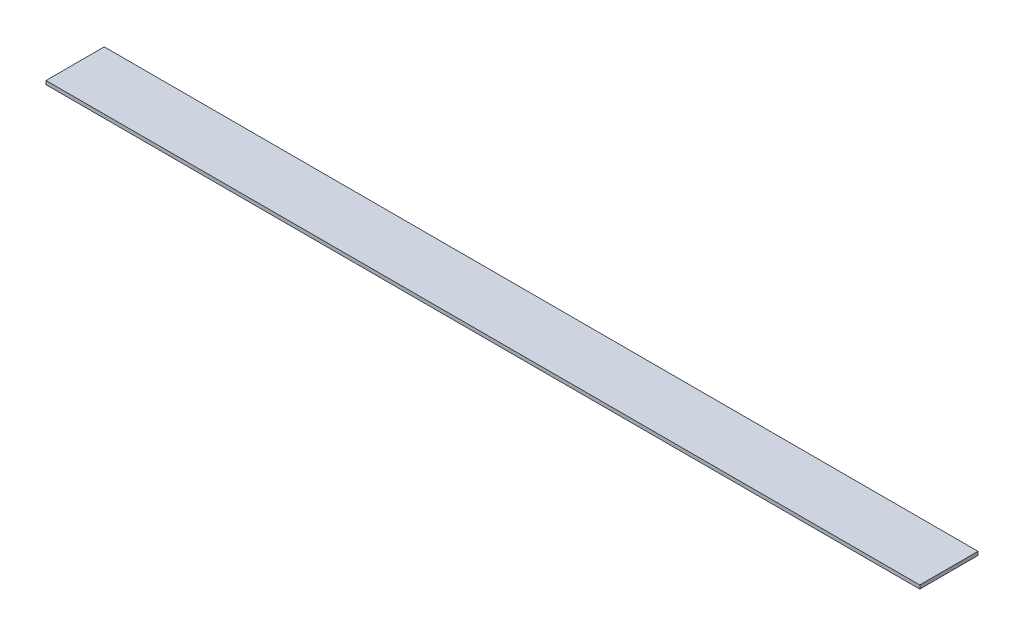
ISO-10303-21;
HEADER;
FILE_DESCRIPTION(('STEP AP214'),'2;1');
FILE_NAME('part.step','',(''),(''),'','','');
FILE_SCHEMA(('AUTOMOTIVE_DESIGN { 1 0 10303 214 1 1 1 1 }'));
ENDSEC;
DATA;
#1=APPLICATION_CONTEXT('core data for automotive mechanical design processes');
#2=APPLICATION_PROTOCOL_DEFINITION('international standard','automotive_design',2000,#1);
#3=PRODUCT_CONTEXT('',#1,'mechanical');
#4=PRODUCT('Part','Part','',(#3));
#5=PRODUCT_RELATED_PRODUCT_CATEGORY('part','',(#4));
#6=PRODUCT_DEFINITION_FORMATION('','',#4);
#7=PRODUCT_DEFINITION_CONTEXT('part definition',#1,'design');
#8=PRODUCT_DEFINITION('design','',#6,#7);
#9=PRODUCT_DEFINITION_SHAPE('','',#8);
#10=(LENGTH_UNIT() NAMED_UNIT(*) SI_UNIT(.MILLI.,.METRE.));
#11=(NAMED_UNIT(*) PLANE_ANGLE_UNIT() SI_UNIT($,.RADIAN.));
#12=(NAMED_UNIT(*) SI_UNIT($,.STERADIAN.) SOLID_ANGLE_UNIT());
#13=UNCERTAINTY_MEASURE_WITH_UNIT(LENGTH_MEASURE(1.E-05),#10,'distance_accuracy_value','');
#14=(GEOMETRIC_REPRESENTATION_CONTEXT(3) GLOBAL_UNCERTAINTY_ASSIGNED_CONTEXT((#13)) GLOBAL_UNIT_ASSIGNED_CONTEXT((#10,
#11,#12)) REPRESENTATION_CONTEXT('',''));
#15=CARTESIAN_POINT('',(0.,0.,0.));
#16=DIRECTION('',(0.,0.,1.));
#17=DIRECTION('',(1.,0.,0.));
#18=AXIS2_PLACEMENT_3D('',#15,#16,#17);
#19=CARTESIAN_POINT('',(0.,1.5875,0.));
#20=DIRECTION('',(1.,0.,0.));
#21=DIRECTION('',(0.,0.,-1.));
#22=AXIS2_PLACEMENT_3D('',#19,#20,#21);
#23=PLANE('',#22);
#24=DIRECTION('',(0.,0.,1.));
#25=VECTOR('',#24,1.);
#26=CARTESIAN_POINT('',(0.,0.,0.));
#27=LINE('',#26,#25);
#28=CARTESIAN_POINT('',(0.,0.,-25.4));
#29=VERTEX_POINT('',#28);
#30=CARTESIAN_POINT('',(0.,0.,0.));
#31=VERTEX_POINT('',#30);
#32=EDGE_CURVE('E96',#29,#31,#27,.T.);
#33=ORIENTED_EDGE('',*,*,#32,.T.);
#34=DIRECTION('',(0.,-1.,0.));
#35=VECTOR('',#34,1.);
#36=CARTESIAN_POINT('',(0.,1.5875,0.));
#37=LINE('',#36,#35);
#38=CARTESIAN_POINT('',(0.,1.5875,0.));
#39=VERTEX_POINT('',#38);
#40=EDGE_CURVE('E11',#39,#31,#37,.T.);
#41=ORIENTED_EDGE('',*,*,#40,.F.);
#42=DIRECTION('',(0.,0.,1.));
#43=VECTOR('',#42,1.);
#44=CARTESIAN_POINT('',(0.,1.5875,0.));
#45=LINE('',#44,#43);
#46=CARTESIAN_POINT('',(0.,1.5875,-25.4));
#47=VERTEX_POINT('',#46);
#48=EDGE_CURVE('E84',#47,#39,#45,.T.);
#49=ORIENTED_EDGE('',*,*,#48,.F.);
#50=DIRECTION('',(0.,-1.,0.));
#51=VECTOR('',#50,1.);
#52=CARTESIAN_POINT('',(0.,1.5875,-25.4));
#53=LINE('',#52,#51);
#54=EDGE_CURVE('E92',#47,#29,#53,.T.);
#55=ORIENTED_EDGE('',*,*,#54,.T.);
#56=EDGE_LOOP('',(#33,#41,#49,#55));
#57=FACE_BOUND('',#56,.T.);
#58=ADVANCED_FACE('F33',(#57),#23,.F.);
#59=CARTESIAN_POINT('',(0.,1.5875,0.));
#60=DIRECTION('',(0.,0.,-1.));
#61=DIRECTION('',(-1.,0.,0.));
#62=AXIS2_PLACEMENT_3D('',#59,#60,#61);
#63=PLANE('',#62);
#64=DIRECTION('',(1.,0.,0.));
#65=VECTOR('',#64,1.);
#66=CARTESIAN_POINT('',(0.,0.,0.));
#67=LINE('',#66,#65);
#68=CARTESIAN_POINT('',(381.,0.,0.));
#69=VERTEX_POINT('',#68);
#70=EDGE_CURVE('E88',#31,#69,#67,.T.);
#71=ORIENTED_EDGE('',*,*,#70,.T.);
#72=DIRECTION('',(0.,-1.,0.));
#73=VECTOR('',#72,1.);
#74=CARTESIAN_POINT('',(381.,1.5875,0.));
#75=LINE('',#74,#73);
#76=CARTESIAN_POINT('',(381.,1.5875,0.));
#77=VERTEX_POINT('',#76);
#78=EDGE_CURVE('E41',#77,#69,#75,.T.);
#79=ORIENTED_EDGE('',*,*,#78,.F.);
#80=DIRECTION('',(1.,0.,0.));
#81=VECTOR('',#80,1.);
#82=CARTESIAN_POINT('',(0.,1.5875,0.));
#83=LINE('',#82,#81);
#84=EDGE_CURVE('E79',#39,#77,#83,.T.);
#85=ORIENTED_EDGE('',*,*,#84,.F.);
#86=ORIENTED_EDGE('',*,*,#40,.T.);
#87=EDGE_LOOP('',(#71,#79,#85,#86));
#88=FACE_BOUND('',#87,.T.);
#89=ADVANCED_FACE('F87',(#88),#63,.F.);
#90=CARTESIAN_POINT('',(381.,1.5875,0.));
#91=DIRECTION('',(-1.,0.,0.));
#92=DIRECTION('',(0.,0.,1.));
#93=AXIS2_PLACEMENT_3D('',#90,#91,#92);
#94=PLANE('',#93);
#95=DIRECTION('',(0.,0.,-1.));
#96=VECTOR('',#95,1.);
#97=CARTESIAN_POINT('',(381.,0.,0.));
#98=LINE('',#97,#96);
#99=CARTESIAN_POINT('',(381.,0.,-25.4));
#100=VERTEX_POINT('',#99);
#101=EDGE_CURVE('E66',#69,#100,#98,.T.);
#102=ORIENTED_EDGE('',*,*,#101,.T.);
#103=DIRECTION('',(0.,-1.,0.));
#104=VECTOR('',#103,1.);
#105=CARTESIAN_POINT('',(381.,1.5875,-25.4));
#106=LINE('',#105,#104);
#107=CARTESIAN_POINT('',(381.,1.5875,-25.4));
#108=VERTEX_POINT('',#107);
#109=EDGE_CURVE('E89',#108,#100,#106,.T.);
#110=ORIENTED_EDGE('',*,*,#109,.F.);
#111=DIRECTION('',(0.,0.,-1.));
#112=VECTOR('',#111,1.);
#113=CARTESIAN_POINT('',(381.,1.5875,0.));
#114=LINE('',#113,#112);
#115=EDGE_CURVE('E82',#77,#108,#114,.T.);
#116=ORIENTED_EDGE('',*,*,#115,.F.);
#117=ORIENTED_EDGE('',*,*,#78,.T.);
#118=EDGE_LOOP('',(#102,#110,#116,#117));
#119=FACE_BOUND('',#118,.T.);
#120=ADVANCED_FACE('F90',(#119),#94,.F.);
#121=CARTESIAN_POINT('',(0.,1.5875,-25.4));
#122=DIRECTION('',(0.,0.,1.));
#123=DIRECTION('',(1.,0.,0.));
#124=AXIS2_PLACEMENT_3D('',#121,#122,#123);
#125=PLANE('',#124);
#126=DIRECTION('',(-1.,0.,0.));
#127=VECTOR('',#126,1.);
#128=CARTESIAN_POINT('',(0.,0.,-25.4));
#129=LINE('',#128,#127);
#130=EDGE_CURVE('E72',#100,#29,#129,.T.);
#131=ORIENTED_EDGE('',*,*,#130,.T.);
#132=ORIENTED_EDGE('',*,*,#54,.F.);
#133=DIRECTION('',(-1.,0.,0.));
#134=VECTOR('',#133,1.);
#135=CARTESIAN_POINT('',(0.,1.5875,-25.4));
#136=LINE('',#135,#134);
#137=EDGE_CURVE('E49',#108,#47,#136,.T.);
#138=ORIENTED_EDGE('',*,*,#137,.F.);
#139=ORIENTED_EDGE('',*,*,#109,.T.);
#140=EDGE_LOOP('',(#131,#132,#138,#139));
#141=FACE_BOUND('',#140,.T.);
#142=ADVANCED_FACE('F103',(#141),#125,.F.);
#143=CARTESIAN_POINT('',(0.,1.5875,0.));
#144=DIRECTION('',(0.,-1.,0.));
#145=DIRECTION('',(0.,0.,-1.));
#146=AXIS2_PLACEMENT_3D('',#143,#144,#145);
#147=PLANE('',#146);
#148=ORIENTED_EDGE('',*,*,#48,.T.);
#149=ORIENTED_EDGE('',*,*,#84,.T.);
#150=ORIENTED_EDGE('',*,*,#115,.T.);
#151=ORIENTED_EDGE('',*,*,#137,.T.);
#152=EDGE_LOOP('',(#148,#149,#150,#151));
#153=FACE_BOUND('',#152,.T.);
#154=ADVANCED_FACE('F80',(#153),#147,.F.);
#155=CARTESIAN_POINT('',(0.,0.,0.));
#156=DIRECTION('',(0.,-1.,0.));
#157=DIRECTION('',(0.,0.,-1.));
#158=AXIS2_PLACEMENT_3D('',#155,#156,#157);
#159=PLANE('',#158);
#160=ORIENTED_EDGE('',*,*,#32,.F.);
#161=ORIENTED_EDGE('',*,*,#130,.F.);
#162=ORIENTED_EDGE('',*,*,#101,.F.);
#163=ORIENTED_EDGE('',*,*,#70,.F.);
#164=EDGE_LOOP('',(#160,#161,#162,#163));
#165=FACE_BOUND('',#164,.T.);
#166=ADVANCED_FACE('F106',(#165),#159,.T.);
#167=CLOSED_SHELL('',(#58,#89,#120,#142,#154,#166));
#168=MANIFOLD_SOLID_BREP('B2',#167);
#169=ADVANCED_BREP_SHAPE_REPRESENTATION('',(#18,#168),#14);
#170=SHAPE_DEFINITION_REPRESENTATION(#9,#169);
ENDSEC;
END-ISO-10303-21;
